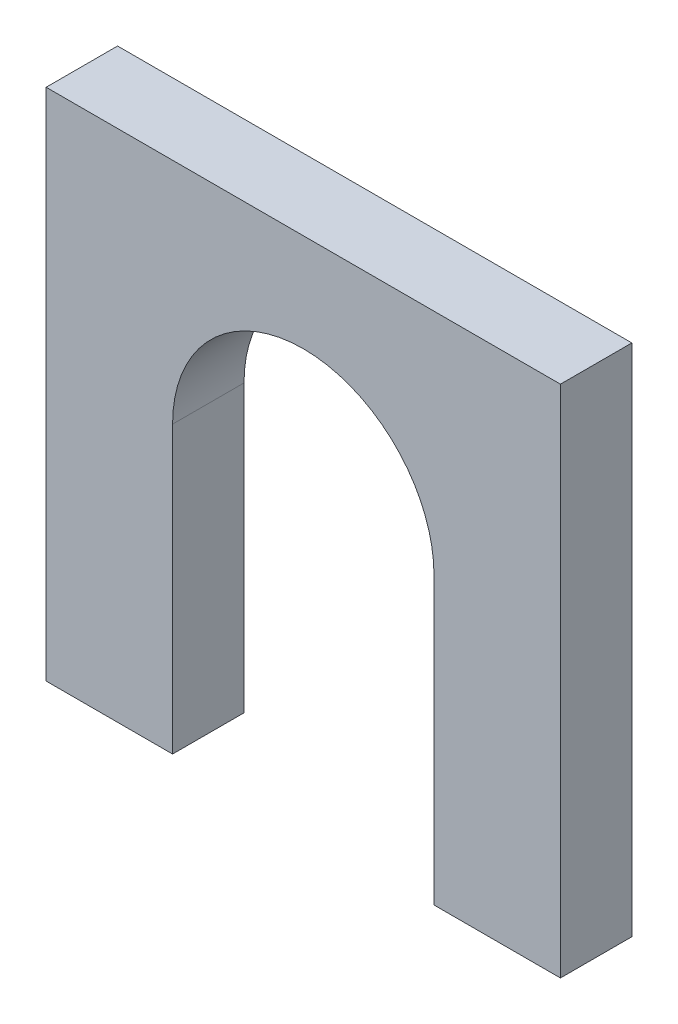
ISO-10303-21;
HEADER;
FILE_DESCRIPTION(('STEP AP214'),'2;1');
FILE_NAME('part.step','',(''),(''),'','','');
FILE_SCHEMA(('AUTOMOTIVE_DESIGN { 1 0 10303 214 1 1 1 1 }'));
ENDSEC;
DATA;
#1=APPLICATION_CONTEXT('core data for automotive mechanical design processes');
#2=APPLICATION_PROTOCOL_DEFINITION('international standard','automotive_design',2000,#1);
#3=PRODUCT_CONTEXT('',#1,'mechanical');
#4=PRODUCT('Part','Part','',(#3));
#5=PRODUCT_RELATED_PRODUCT_CATEGORY('part','',(#4));
#6=PRODUCT_DEFINITION_FORMATION('','',#4);
#7=PRODUCT_DEFINITION_CONTEXT('part definition',#1,'design');
#8=PRODUCT_DEFINITION('design','',#6,#7);
#9=PRODUCT_DEFINITION_SHAPE('','',#8);
#10=(LENGTH_UNIT() NAMED_UNIT(*) SI_UNIT(.MILLI.,.METRE.));
#11=(NAMED_UNIT(*) PLANE_ANGLE_UNIT() SI_UNIT($,.RADIAN.));
#12=(NAMED_UNIT(*) SI_UNIT($,.STERADIAN.) SOLID_ANGLE_UNIT());
#13=UNCERTAINTY_MEASURE_WITH_UNIT(LENGTH_MEASURE(1.E-05),#10,'distance_accuracy_value','');
#14=(GEOMETRIC_REPRESENTATION_CONTEXT(3) GLOBAL_UNCERTAINTY_ASSIGNED_CONTEXT((#13)) GLOBAL_UNIT_ASSIGNED_CONTEXT((#10,
#11,#12)) REPRESENTATION_CONTEXT('',''));
#15=CARTESIAN_POINT('',(0.,0.,0.));
#16=DIRECTION('',(0.,0.,1.));
#17=DIRECTION('',(1.,0.,0.));
#18=AXIS2_PLACEMENT_3D('',#15,#16,#17);
#19=CARTESIAN_POINT('',(0.,0.,6.35));
#20=DIRECTION('',(1.,0.,0.));
#21=DIRECTION('',(0.,0.,-1.));
#22=AXIS2_PLACEMENT_3D('',#19,#20,#21);
#23=PLANE('',#22);
#24=DIRECTION('',(0.,-1.,0.));
#25=VECTOR('',#24,1.);
#26=CARTESIAN_POINT('',(0.,0.,0.));
#27=LINE('',#26,#25);
#28=CARTESIAN_POINT('',(0.,45.72,0.));
#29=VERTEX_POINT('',#28);
#30=CARTESIAN_POINT('',(0.,0.,0.));
#31=VERTEX_POINT('',#30);
#32=EDGE_CURVE('E129',#29,#31,#27,.T.);
#33=ORIENTED_EDGE('',*,*,#32,.T.);
#34=DIRECTION('',(0.,0.,-1.));
#35=VECTOR('',#34,1.);
#36=CARTESIAN_POINT('',(0.,0.,6.35));
#37=LINE('',#36,#35);
#38=CARTESIAN_POINT('',(0.,0.,6.35));
#39=VERTEX_POINT('',#38);
#40=EDGE_CURVE('E11',#39,#31,#37,.T.);
#41=ORIENTED_EDGE('',*,*,#40,.F.);
#42=DIRECTION('',(0.,-1.,0.));
#43=VECTOR('',#42,1.);
#44=CARTESIAN_POINT('',(0.,0.,6.35));
#45=LINE('',#44,#43);
#46=CARTESIAN_POINT('',(0.,45.72,6.35));
#47=VERTEX_POINT('',#46);
#48=EDGE_CURVE('E143',#47,#39,#45,.T.);
#49=ORIENTED_EDGE('',*,*,#48,.F.);
#50=DIRECTION('',(0.,0.,-1.));
#51=VECTOR('',#50,1.);
#52=CARTESIAN_POINT('',(0.,45.72,6.35));
#53=LINE('',#52,#51);
#54=EDGE_CURVE('E125',#47,#29,#53,.T.);
#55=ORIENTED_EDGE('',*,*,#54,.T.);
#56=EDGE_LOOP('',(#33,#41,#49,#55));
#57=FACE_BOUND('',#56,.T.);
#58=ADVANCED_FACE('F33',(#57),#23,.F.);
#59=CARTESIAN_POINT('',(0.,0.,6.35));
#60=DIRECTION('',(0.,1.,0.));
#61=DIRECTION('',(0.,0.,1.));
#62=AXIS2_PLACEMENT_3D('',#59,#60,#61);
#63=PLANE('',#62);
#64=DIRECTION('',(1.,0.,0.));
#65=VECTOR('',#64,1.);
#66=CARTESIAN_POINT('',(0.,0.,0.));
#67=LINE('',#66,#65);
#68=CARTESIAN_POINT('',(11.2395,0.,0.));
#69=VERTEX_POINT('',#68);
#70=EDGE_CURVE('E132',#31,#69,#67,.T.);
#71=ORIENTED_EDGE('',*,*,#70,.T.);
#72=DIRECTION('',(0.,0.,-1.));
#73=VECTOR('',#72,1.);
#74=CARTESIAN_POINT('',(11.2395,0.,6.35));
#75=LINE('',#74,#73);
#76=CARTESIAN_POINT('',(11.2395,0.,6.35));
#77=VERTEX_POINT('',#76);
#78=EDGE_CURVE('E41',#77,#69,#75,.T.);
#79=ORIENTED_EDGE('',*,*,#78,.F.);
#80=DIRECTION('',(1.,0.,0.));
#81=VECTOR('',#80,1.);
#82=CARTESIAN_POINT('',(0.,0.,6.35));
#83=LINE('',#82,#81);
#84=EDGE_CURVE('E92',#39,#77,#83,.T.);
#85=ORIENTED_EDGE('',*,*,#84,.F.);
#86=ORIENTED_EDGE('',*,*,#40,.T.);
#87=EDGE_LOOP('',(#71,#79,#85,#86));
#88=FACE_BOUND('',#87,.T.);
#89=ADVANCED_FACE('F178',(#88),#63,.F.);
#90=CARTESIAN_POINT('',(11.2395,25.4,6.35));
#91=DIRECTION('',(-1.,0.,0.));
#92=DIRECTION('',(0.,-1.,0.));
#93=AXIS2_PLACEMENT_3D('',#90,#91,#92);
#94=PLANE('',#93);
#95=DIRECTION('',(0.,1.,0.));
#96=VECTOR('',#95,1.);
#97=CARTESIAN_POINT('',(11.2395,25.4,0.));
#98=LINE('',#97,#96);
#99=CARTESIAN_POINT('',(11.2395,25.4,0.));
#100=VERTEX_POINT('',#99);
#101=EDGE_CURVE('E134',#69,#100,#98,.T.);
#102=ORIENTED_EDGE('',*,*,#101,.T.);
#103=DIRECTION('',(0.,0.,-1.));
#104=VECTOR('',#103,1.);
#105=CARTESIAN_POINT('',(11.2395,25.4,6.35));
#106=LINE('',#105,#104);
#107=CARTESIAN_POINT('',(11.2395,25.4,6.35));
#108=VERTEX_POINT('',#107);
#109=EDGE_CURVE('E150',#108,#100,#106,.T.);
#110=ORIENTED_EDGE('',*,*,#109,.F.);
#111=DIRECTION('',(0.,1.,0.));
#112=VECTOR('',#111,1.);
#113=CARTESIAN_POINT('',(11.2395,25.4,6.35));
#114=LINE('',#113,#112);
#115=EDGE_CURVE('E158',#77,#108,#114,.T.);
#116=ORIENTED_EDGE('',*,*,#115,.F.);
#117=ORIENTED_EDGE('',*,*,#78,.T.);
#118=EDGE_LOOP('',(#102,#110,#116,#117));
#119=FACE_BOUND('',#118,.T.);
#120=ADVANCED_FACE('F156',(#119),#94,.F.);
#121=CARTESIAN_POINT('',(22.86,25.4,6.35));
#122=DIRECTION('',(0.,0.,-1.));
#123=DIRECTION('',(-1.,0.,0.));
#124=AXIS2_PLACEMENT_3D('',#121,#122,#123);
#125=CYLINDRICAL_SURFACE('',#124,11.6205);
#126=CARTESIAN_POINT('',(22.86,25.4,0.));
#127=DIRECTION('',(0.,0.,-1.));
#128=DIRECTION('',(1.,0.,0.));
#129=AXIS2_PLACEMENT_3D('',#126,#127,#128);
#130=CIRCLE('',#129,11.6205);
#131=CARTESIAN_POINT('',(34.4805,25.4,0.));
#132=VERTEX_POINT('',#131);
#133=EDGE_CURVE('E136',#100,#132,#130,.T.);
#134=ORIENTED_EDGE('',*,*,#133,.T.);
#135=DIRECTION('',(0.,0.,-1.));
#136=VECTOR('',#135,1.);
#137=CARTESIAN_POINT('',(34.4805,25.4,6.35));
#138=LINE('',#137,#136);
#139=CARTESIAN_POINT('',(34.4805,25.4,6.35));
#140=VERTEX_POINT('',#139);
#141=EDGE_CURVE('E147',#140,#132,#138,.T.);
#142=ORIENTED_EDGE('',*,*,#141,.F.);
#143=CARTESIAN_POINT('',(22.86,25.4,6.35));
#144=DIRECTION('',(0.,0.,-1.));
#145=DIRECTION('',(1.,0.,0.));
#146=AXIS2_PLACEMENT_3D('',#143,#144,#145);
#147=CIRCLE('',#146,11.6205);
#148=EDGE_CURVE('E170',#108,#140,#147,.T.);
#149=ORIENTED_EDGE('',*,*,#148,.F.);
#150=ORIENTED_EDGE('',*,*,#109,.T.);
#151=EDGE_LOOP('',(#134,#142,#149,#150));
#152=FACE_BOUND('',#151,.T.);
#153=ADVANCED_FACE('F166',(#152),#125,.F.);
#154=CARTESIAN_POINT('',(34.4805,25.4,6.35));
#155=DIRECTION('',(1.,0.,0.));
#156=DIRECTION('',(0.,0.,-1.));
#157=AXIS2_PLACEMENT_3D('',#154,#155,#156);
#158=PLANE('',#157);
#159=DIRECTION('',(0.,-1.,0.));
#160=VECTOR('',#159,1.);
#161=CARTESIAN_POINT('',(34.4805,25.4,0.));
#162=LINE('',#161,#160);
#163=CARTESIAN_POINT('',(34.4805,0.,0.));
#164=VERTEX_POINT('',#163);
#165=EDGE_CURVE('E138',#132,#164,#162,.T.);
#166=ORIENTED_EDGE('',*,*,#165,.T.);
#167=DIRECTION('',(0.,0.,-1.));
#168=VECTOR('',#167,1.);
#169=CARTESIAN_POINT('',(34.4805,0.,6.35));
#170=LINE('',#169,#168);
#171=CARTESIAN_POINT('',(34.4805,0.,6.35));
#172=VERTEX_POINT('',#171);
#173=EDGE_CURVE('E120',#172,#164,#170,.T.);
#174=ORIENTED_EDGE('',*,*,#173,.F.);
#175=DIRECTION('',(0.,-1.,0.));
#176=VECTOR('',#175,1.);
#177=CARTESIAN_POINT('',(34.4805,25.4,6.35));
#178=LINE('',#177,#176);
#179=EDGE_CURVE('E111',#140,#172,#178,.T.);
#180=ORIENTED_EDGE('',*,*,#179,.F.);
#181=ORIENTED_EDGE('',*,*,#141,.T.);
#182=EDGE_LOOP('',(#166,#174,#180,#181));
#183=FACE_BOUND('',#182,.T.);
#184=ADVANCED_FACE('F169',(#183),#158,.F.);
#185=CARTESIAN_POINT('',(34.4805,0.,6.35));
#186=DIRECTION('',(0.,1.,0.));
#187=DIRECTION('',(-1.,0.,0.));
#188=AXIS2_PLACEMENT_3D('',#185,#186,#187);
#189=PLANE('',#188);
#190=DIRECTION('',(1.,0.,0.));
#191=VECTOR('',#190,1.);
#192=CARTESIAN_POINT('',(34.4805,0.,0.));
#193=LINE('',#192,#191);
#194=CARTESIAN_POINT('',(45.72,0.,0.));
#195=VERTEX_POINT('',#194);
#196=EDGE_CURVE('E119',#164,#195,#193,.T.);
#197=ORIENTED_EDGE('',*,*,#196,.T.);
#198=DIRECTION('',(0.,0.,-1.));
#199=VECTOR('',#198,1.);
#200=CARTESIAN_POINT('',(45.72,0.,6.35));
#201=LINE('',#200,#199);
#202=CARTESIAN_POINT('',(45.72,0.,6.35));
#203=VERTEX_POINT('',#202);
#204=EDGE_CURVE('E116',#203,#195,#201,.T.);
#205=ORIENTED_EDGE('',*,*,#204,.F.);
#206=DIRECTION('',(1.,0.,0.));
#207=VECTOR('',#206,1.);
#208=CARTESIAN_POINT('',(34.4805,0.,6.35));
#209=LINE('',#208,#207);
#210=EDGE_CURVE('E105',#172,#203,#209,.T.);
#211=ORIENTED_EDGE('',*,*,#210,.F.);
#212=ORIENTED_EDGE('',*,*,#173,.T.);
#213=EDGE_LOOP('',(#197,#205,#211,#212));
#214=FACE_BOUND('',#213,.T.);
#215=ADVANCED_FACE('F117',(#214),#189,.F.);
#216=CARTESIAN_POINT('',(45.72,0.,6.35));
#217=DIRECTION('',(-1.,0.,0.));
#218=DIRECTION('',(0.,-1.,0.));
#219=AXIS2_PLACEMENT_3D('',#216,#217,#218);
#220=PLANE('',#219);
#221=DIRECTION('',(0.,1.,0.));
#222=VECTOR('',#221,1.);
#223=CARTESIAN_POINT('',(45.72,0.,0.));
#224=LINE('',#223,#222);
#225=CARTESIAN_POINT('',(45.72,45.72,0.));
#226=VERTEX_POINT('',#225);
#227=EDGE_CURVE('E78',#195,#226,#224,.T.);
#228=ORIENTED_EDGE('',*,*,#227,.T.);
#229=DIRECTION('',(0.,0.,-1.));
#230=VECTOR('',#229,1.);
#231=CARTESIAN_POINT('',(45.72,45.72,6.35));
#232=LINE('',#231,#230);
#233=CARTESIAN_POINT('',(45.72,45.72,6.35));
#234=VERTEX_POINT('',#233);
#235=EDGE_CURVE('E121',#234,#226,#232,.T.);
#236=ORIENTED_EDGE('',*,*,#235,.F.);
#237=DIRECTION('',(0.,1.,0.));
#238=VECTOR('',#237,1.);
#239=CARTESIAN_POINT('',(45.72,0.,6.35));
#240=LINE('',#239,#238);
#241=EDGE_CURVE('E109',#203,#234,#240,.T.);
#242=ORIENTED_EDGE('',*,*,#241,.F.);
#243=ORIENTED_EDGE('',*,*,#204,.T.);
#244=EDGE_LOOP('',(#228,#236,#242,#243));
#245=FACE_BOUND('',#244,.T.);
#246=ADVANCED_FACE('F123',(#245),#220,.F.);
#247=CARTESIAN_POINT('',(0.,45.72,6.35));
#248=DIRECTION('',(0.,-1.,0.));
#249=DIRECTION('',(0.,0.,-1.));
#250=AXIS2_PLACEMENT_3D('',#247,#248,#249);
#251=PLANE('',#250);
#252=DIRECTION('',(-1.,0.,0.));
#253=VECTOR('',#252,1.);
#254=CARTESIAN_POINT('',(0.,45.72,0.));
#255=LINE('',#254,#253);
#256=EDGE_CURVE('E84',#226,#29,#255,.T.);
#257=ORIENTED_EDGE('',*,*,#256,.T.);
#258=ORIENTED_EDGE('',*,*,#54,.F.);
#259=DIRECTION('',(-1.,0.,0.));
#260=VECTOR('',#259,1.);
#261=CARTESIAN_POINT('',(0.,45.72,6.35));
#262=LINE('',#261,#260);
#263=EDGE_CURVE('E49',#234,#47,#262,.T.);
#264=ORIENTED_EDGE('',*,*,#263,.F.);
#265=ORIENTED_EDGE('',*,*,#235,.T.);
#266=EDGE_LOOP('',(#257,#258,#264,#265));
#267=FACE_BOUND('',#266,.T.);
#268=ADVANCED_FACE('F194',(#267),#251,.F.);
#269=CARTESIAN_POINT('',(22.86,25.4,6.35));
#270=DIRECTION('',(0.,0.,1.));
#271=DIRECTION('',(1.,0.,0.));
#272=AXIS2_PLACEMENT_3D('',#269,#270,#271);
#273=PLANE('',#272);
#274=ORIENTED_EDGE('',*,*,#48,.T.);
#275=ORIENTED_EDGE('',*,*,#84,.T.);
#276=ORIENTED_EDGE('',*,*,#115,.T.);
#277=ORIENTED_EDGE('',*,*,#148,.T.);
#278=ORIENTED_EDGE('',*,*,#179,.T.);
#279=ORIENTED_EDGE('',*,*,#210,.T.);
#280=ORIENTED_EDGE('',*,*,#241,.T.);
#281=ORIENTED_EDGE('',*,*,#263,.T.);
#282=EDGE_LOOP('',(#274,#275,#276,#277,#278,#279,#280,#281));
#283=FACE_BOUND('',#282,.T.);
#284=ADVANCED_FACE('F107',(#283),#273,.T.);
#285=CARTESIAN_POINT('',(22.86,25.4,0.));
#286=DIRECTION('',(0.,0.,1.));
#287=DIRECTION('',(1.,0.,0.));
#288=AXIS2_PLACEMENT_3D('',#285,#286,#287);
#289=PLANE('',#288);
#290=ORIENTED_EDGE('',*,*,#32,.F.);
#291=ORIENTED_EDGE('',*,*,#256,.F.);
#292=ORIENTED_EDGE('',*,*,#227,.F.);
#293=ORIENTED_EDGE('',*,*,#196,.F.);
#294=ORIENTED_EDGE('',*,*,#165,.F.);
#295=ORIENTED_EDGE('',*,*,#133,.F.);
#296=ORIENTED_EDGE('',*,*,#101,.F.);
#297=ORIENTED_EDGE('',*,*,#70,.F.);
#298=EDGE_LOOP('',(#290,#291,#292,#293,#294,#295,#296,#297));
#299=FACE_BOUND('',#298,.T.);
#300=ADVANCED_FACE('F162',(#299),#289,.F.);
#301=CLOSED_SHELL('',(#58,#89,#120,#153,#184,#215,#246,#268,#284,#300));
#302=MANIFOLD_SOLID_BREP('B2',#301);
#303=ADVANCED_BREP_SHAPE_REPRESENTATION('',(#18,#302),#14);
#304=SHAPE_DEFINITION_REPRESENTATION(#9,#303);
ENDSEC;
END-ISO-10303-21;
